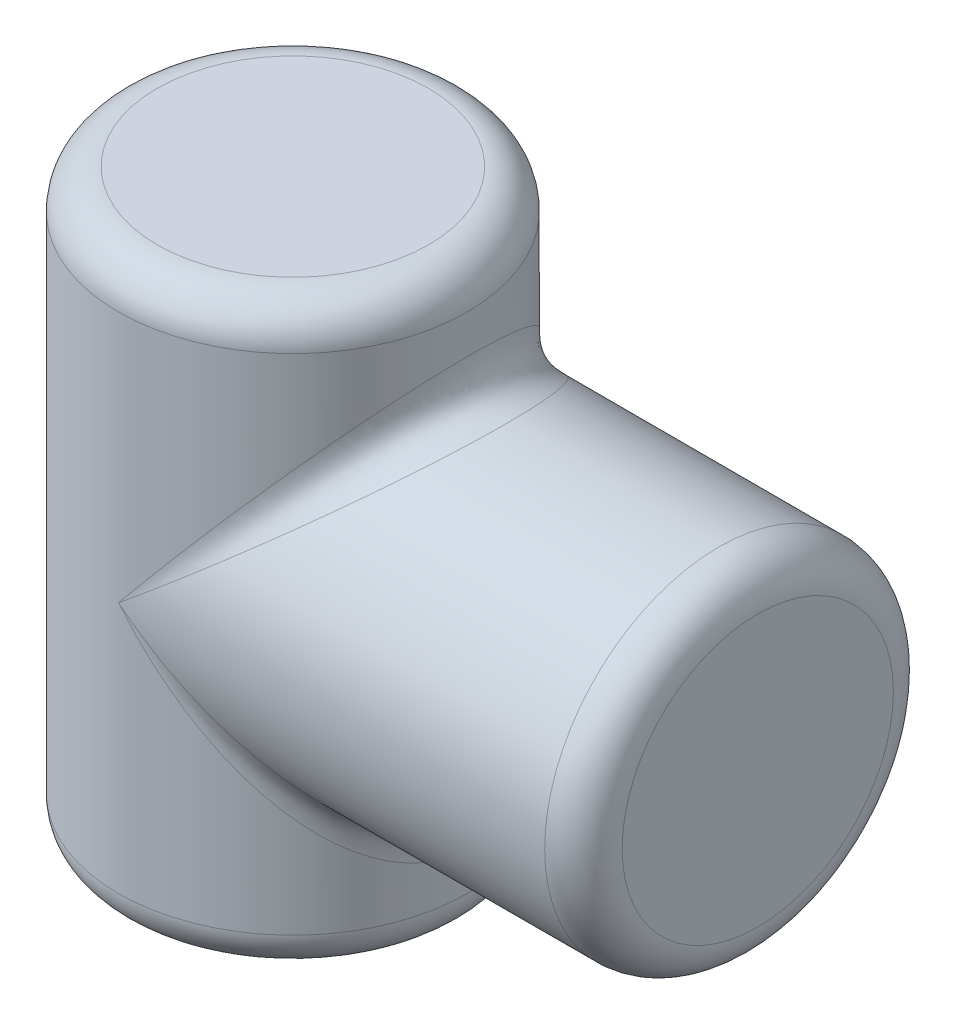
ISO-10303-21;
HEADER;
FILE_DESCRIPTION(('STEP AP214'),'2;1');
FILE_NAME('part.step','',(''),(''),'','','');
FILE_SCHEMA(('AUTOMOTIVE_DESIGN { 1 0 10303 214 1 1 1 1 }'));
ENDSEC;
DATA;
#1=APPLICATION_CONTEXT('core data for automotive mechanical design processes');
#2=APPLICATION_PROTOCOL_DEFINITION('international standard','automotive_design',2000,#1);
#3=PRODUCT_CONTEXT('',#1,'mechanical');
#4=PRODUCT('Part','Part','',(#3));
#5=PRODUCT_RELATED_PRODUCT_CATEGORY('part','',(#4));
#6=PRODUCT_DEFINITION_FORMATION('','',#4);
#7=PRODUCT_DEFINITION_CONTEXT('part definition',#1,'design');
#8=PRODUCT_DEFINITION('design','',#6,#7);
#9=PRODUCT_DEFINITION_SHAPE('','',#8);
#10=(LENGTH_UNIT() NAMED_UNIT(*) SI_UNIT(.MILLI.,.METRE.));
#11=(NAMED_UNIT(*) PLANE_ANGLE_UNIT() SI_UNIT($,.RADIAN.));
#12=(NAMED_UNIT(*) SI_UNIT($,.STERADIAN.) SOLID_ANGLE_UNIT());
#13=UNCERTAINTY_MEASURE_WITH_UNIT(LENGTH_MEASURE(1.E-05),#10,'distance_accuracy_value','');
#14=(GEOMETRIC_REPRESENTATION_CONTEXT(3) GLOBAL_UNCERTAINTY_ASSIGNED_CONTEXT((#13)) GLOBAL_UNIT_ASSIGNED_CONTEXT((#10,
#11,#12)) REPRESENTATION_CONTEXT('',''));
#15=CARTESIAN_POINT('',(0.,0.,0.));
#16=DIRECTION('',(0.,0.,1.));
#17=DIRECTION('',(1.,0.,0.));
#18=AXIS2_PLACEMENT_3D('',#15,#16,#17);
#19=CARTESIAN_POINT('',(0.,150.,0.));
#20=DIRECTION('',(0.,-1.,0.));
#21=DIRECTION('',(0.,0.,-1.));
#22=AXIS2_PLACEMENT_3D('',#19,#20,#21);
#23=CYLINDRICAL_SURFACE('',#22,45.);
#24=CARTESIAN_POINT('',(0.,140.,0.));
#25=DIRECTION('',(0.,1.,0.));
#26=DIRECTION('',(0.,0.,1.));
#27=AXIS2_PLACEMENT_3D('',#24,#25,#26);
#28=CIRCLE('',#27,45.);
#29=CARTESIAN_POINT('',(0.,140.,45.));
#30=VERTEX_POINT('',#29);
#31=EDGE_CURVE('E181',#30,#30,#28,.F.);
#32=ORIENTED_EDGE('',*,*,#31,.T.);
#33=EDGE_LOOP('',(#32));
#34=FACE_BOUND('',#33,.T.);
#35=CARTESIAN_POINT('',(0.,10.,0.));
#36=DIRECTION('',(0.,1.,0.));
#37=DIRECTION('',(0.,0.,1.));
#38=AXIS2_PLACEMENT_3D('',#35,#36,#37);
#39=CIRCLE('',#38,45.);
#40=CARTESIAN_POINT('',(0.,10.,45.));
#41=VERTEX_POINT('',#40);
#42=EDGE_CURVE('E178',#41,#41,#39,.T.);
#43=ORIENTED_EDGE('',*,*,#42,.T.);
#44=EDGE_LOOP('',(#43));
#45=FACE_BOUND('',#44,.T.);
#46=CARTESIAN_POINT('',(0.,75.,-45.));
#47=CARTESIAN_POINT('',(2.94524311290272,78.5997415823966,-45.));
#48=CARTESIAN_POINT('',(8.83564470275748,85.7991213033888,-44.4198425579063));
#49=CARTESIAN_POINT('',(17.3317658153497,96.1832693298669,-41.8425767562001));
#50=CARTESIAN_POINT('',(25.1618187744183,105.753334057624,-37.6573241953405));
#51=CARTESIAN_POINT('',(32.0249220022702,114.141571336108,-32.0249217841248));
#52=CARTESIAN_POINT('',(37.6573241368687,121.025618389506,-25.1618195885281));
#53=CARTESIAN_POINT('',(41.8425767719426,126.140927165708,-17.3317627770553));
#54=CARTESIAN_POINT('',(44.4198425534085,129.290918676388,-8.83565604182475));
#55=CARTESIAN_POINT('',(45.2900787232958,130.354540661806,0.));
#56=CARTESIAN_POINT('',(44.4198425534085,129.290918676388,8.83565604182487));
#57=CARTESIAN_POINT('',(41.8425767719426,126.140927165708,17.3317627770554));
#58=CARTESIAN_POINT('',(37.6573241368686,121.025618389506,25.1618195885282));
#59=CARTESIAN_POINT('',(32.0249220022704,114.141571336107,32.0249217841247));
#60=CARTESIAN_POINT('',(25.1618187744181,105.753334057625,37.6573241953406));
#61=CARTESIAN_POINT('',(17.3317658153497,96.1832693298604,41.8425767562001));
#62=CARTESIAN_POINT('',(8.83564470275734,85.799121303413,44.4198425579063));
#63=CARTESIAN_POINT('',(2.9452431129027,78.5997415823443,45.));
#64=CARTESIAN_POINT('',(0.,75.,45.));
#65=B_SPLINE_CURVE_WITH_KNOTS('',3,(#46,#47,#48,#49,#50,#51,#52,#53,#54,#55,#56,#57,#58,#59,#60,
#61,#62,#63,#64),.UNSPECIFIED.,.F.,.F.,(4,1,1,1,1,1,1,1,1,1,1,1,1,1,1,1,4),(1.5707963267949,
1.76714586764426,1.96349540849362,2.15984494934298,2.35619449019235,2.55254403104171,
2.74889357189107,2.94524311274043,3.14159265358979,3.33794219443915,3.53429173528852,
3.73064127613788,3.92699081698724,4.1233403578366,4.31968989868597,4.51603943953533,
4.71238898038469),.UNSPECIFIED.);
#66=CARTESIAN_POINT('',(0.,75.,45.));
#67=VERTEX_POINT('',#66);
#68=CARTESIAN_POINT('',(0.,75.,-45.));
#69=VERTEX_POINT('',#68);
#70=EDGE_CURVE('E63',#67,#69,#65,.F.);
#71=ORIENTED_EDGE('',*,*,#70,.T.);
#72=CARTESIAN_POINT('',(0.,75.,45.));
#73=CARTESIAN_POINT('',(2.94524311290272,71.4002584176034,45.));
#74=CARTESIAN_POINT('',(8.83564470275748,64.2008786966112,44.4198425579063));
#75=CARTESIAN_POINT('',(17.3317658153497,53.8167306701331,41.8425767562001));
#76=CARTESIAN_POINT('',(25.1618187744183,44.2466659423764,37.6573241953406));
#77=CARTESIAN_POINT('',(32.0249220022702,35.8584286638923,32.0249217841249));
#78=CARTESIAN_POINT('',(37.6573241368687,28.9743816104938,25.1618195885281));
#79=CARTESIAN_POINT('',(41.8425767719426,23.8590728342924,17.3317627770553));
#80=CARTESIAN_POINT('',(44.4198425534085,20.7090813236118,8.83565604182476));
#81=CARTESIAN_POINT('',(45.2900787232958,19.6454593381941,0.));
#82=CARTESIAN_POINT('',(44.4198425534085,20.7090813236118,-8.83565604182486));
#83=CARTESIAN_POINT('',(41.8425767719426,23.8590728342925,-17.3317627770554));
#84=CARTESIAN_POINT('',(37.6573241368686,28.9743816104938,-25.1618195885282));
#85=CARTESIAN_POINT('',(32.0249220022704,35.8584286638926,-32.0249217841247));
#86=CARTESIAN_POINT('',(25.1618187744181,44.2466659423748,-37.6573241953406));
#87=CARTESIAN_POINT('',(17.3317658153497,53.8167306701396,-41.8425767562001));
#88=CARTESIAN_POINT('',(8.83564470275734,64.2008786965871,-44.4198425579063));
#89=CARTESIAN_POINT('',(2.9452431129027,71.4002584176557,-45.));
#90=CARTESIAN_POINT('',(0.,75.,-45.));
#91=B_SPLINE_CURVE_WITH_KNOTS('',3,(#72,#73,#74,#75,#76,#77,#78,#79,#80,#81,#82,#83,#84,#85,#86,
#87,#88,#89,#90),.UNSPECIFIED.,.F.,.F.,(4,1,1,1,1,1,1,1,1,1,1,1,1,1,1,1,4),(1.5707963267949,
1.76714586764426,1.96349540849362,2.15984494934298,2.35619449019235,2.55254403104171,
2.74889357189107,2.94524311274043,3.14159265358979,3.33794219443915,3.53429173528852,
3.73064127613788,3.92699081698724,4.1233403578366,4.31968989868597,4.51603943953533,
4.71238898038469),.UNSPECIFIED.);
#92=EDGE_CURVE('E57',#69,#67,#91,.F.);
#93=ORIENTED_EDGE('',*,*,#92,.T.);
#94=EDGE_LOOP('',(#71,#93));
#95=FACE_BOUND('',#94,.T.);
#96=ADVANCED_FACE('F43',(#34,#45,#95),#23,.T.);
#97=CARTESIAN_POINT('',(0.,150.,0.));
#98=DIRECTION('',(0.,1.,0.));
#99=DIRECTION('',(0.,0.,1.));
#100=AXIS2_PLACEMENT_3D('',#97,#98,#99);
#101=PLANE('',#100);
#102=CARTESIAN_POINT('',(0.,150.,0.));
#103=DIRECTION('',(0.,1.,0.));
#104=DIRECTION('',(0.,0.,1.));
#105=AXIS2_PLACEMENT_3D('',#102,#103,#104);
#106=CIRCLE('',#105,35.);
#107=CARTESIAN_POINT('',(0.,150.,35.));
#108=VERTEX_POINT('',#107);
#109=EDGE_CURVE('E76',#108,#108,#106,.T.);
#110=ORIENTED_EDGE('',*,*,#109,.T.);
#111=EDGE_LOOP('',(#110));
#112=FACE_BOUND('',#111,.T.);
#113=ADVANCED_FACE('F199',(#112),#101,.T.);
#114=CARTESIAN_POINT('',(0.,0.,0.));
#115=DIRECTION('',(0.,1.,0.));
#116=DIRECTION('',(0.,0.,1.));
#117=AXIS2_PLACEMENT_3D('',#114,#115,#116);
#118=PLANE('',#117);
#119=CARTESIAN_POINT('',(0.,0.,0.));
#120=DIRECTION('',(0.,1.,0.));
#121=DIRECTION('',(0.,0.,1.));
#122=AXIS2_PLACEMENT_3D('',#119,#120,#121);
#123=CIRCLE('',#122,35.);
#124=CARTESIAN_POINT('',(0.,0.,35.));
#125=VERTEX_POINT('',#124);
#126=EDGE_CURVE('E184',#125,#125,#123,.F.);
#127=ORIENTED_EDGE('',*,*,#126,.T.);
#128=EDGE_LOOP('',(#127));
#129=FACE_BOUND('',#128,.T.);
#130=ADVANCED_FACE('F205',(#129),#118,.F.);
#131=CARTESIAN_POINT('',(120.,75.,0.));
#132=DIRECTION('',(-1.,0.,0.));
#133=DIRECTION('',(0.,0.,1.));
#134=AXIS2_PLACEMENT_3D('',#131,#132,#133);
#135=CYLINDRICAL_SURFACE('',#134,45.);
#136=CARTESIAN_POINT('',(110.,75.,0.));
#137=DIRECTION('',(1.,0.,0.));
#138=DIRECTION('',(0.,0.,-1.));
#139=AXIS2_PLACEMENT_3D('',#136,#137,#138);
#140=CIRCLE('',#139,45.);
#141=CARTESIAN_POINT('',(110.,75.,-45.));
#142=VERTEX_POINT('',#141);
#143=EDGE_CURVE('E12',#142,#142,#140,.F.);
#144=ORIENTED_EDGE('',*,*,#143,.T.);
#145=EDGE_LOOP('',(#144));
#146=FACE_BOUND('',#145,.T.);
#147=CARTESIAN_POINT('',(0.,75.,45.));
#148=CARTESIAN_POINT('',(3.59974158243664,77.9452431127758,45.));
#149=CARTESIAN_POINT('',(10.7991213033701,83.8356447028163,44.4198425579063));
#150=CARTESIAN_POINT('',(21.1832693298719,92.331765815334,41.8425767562001));
#151=CARTESIAN_POINT('',(30.7533340576221,100.161818774422,37.6573241953406));
#152=CARTESIAN_POINT('',(39.1415713361082,107.024922002269,32.0249217841248));
#153=CARTESIAN_POINT('',(46.025618389506,112.657324136869,25.1618195885282));
#154=CARTESIAN_POINT('',(51.1409271657076,116.842576771943,17.3317627770554));
#155=CARTESIAN_POINT('',(54.2909186763881,119.419842553408,8.83565604182487));
#156=CARTESIAN_POINT('',(55.3545406618059,120.290078723296,0.));
#157=CARTESIAN_POINT('',(54.2909186763881,119.419842553409,-8.83565604182475));
#158=CARTESIAN_POINT('',(51.1409271657076,116.842576771943,-17.3317627770552));
#159=CARTESIAN_POINT('',(46.0256183895061,112.657324136869,-25.1618195885281));
#160=CARTESIAN_POINT('',(39.141571336108,107.02492200227,-32.0249217841248));
#161=CARTESIAN_POINT('',(30.7533340576223,100.161818774419,-37.6573241953405));
#162=CARTESIAN_POINT('',(21.1832693298719,92.3317658153477,-41.8425767562001));
#163=CARTESIAN_POINT('',(10.7991213033703,83.8356447027652,-44.4198425579063));
#164=CARTESIAN_POINT('',(3.59974158243665,77.945243112886,-45.));
#165=CARTESIAN_POINT('',(0.,75.,-45.));
#166=B_SPLINE_CURVE_WITH_KNOTS('',3,(#147,#148,#149,#150,#151,#152,#153,#154,#155,#156,#157,
#158,#159,#160,#161,#162,#163,#164,#165),.UNSPECIFIED.,.F.,.F.,(4,1,1,1,1,1,1,1,1,1,1,1,1,1,1,1,
4),(1.5707963267949,1.76714586764426,1.96349540849362,2.15984494934298,2.35619449019234,
2.55254403104171,2.74889357189107,2.94524311274043,3.14159265358979,3.33794219443915,
3.53429173528852,3.73064127613788,3.92699081698724,4.1233403578366,4.31968989868597,
4.51603943953533,4.71238898038469),.UNSPECIFIED.);
#167=EDGE_CURVE('E67',#69,#67,#166,.F.);
#168=ORIENTED_EDGE('',*,*,#167,.T.);
#169=CARTESIAN_POINT('',(0.,75.,-45.));
#170=CARTESIAN_POINT('',(3.59974158243664,72.0547568872242,-45.));
#171=CARTESIAN_POINT('',(10.7991213033701,66.1643552971838,-44.4198425579063));
#172=CARTESIAN_POINT('',(21.1832693298719,57.668234184666,-41.8425767562001));
#173=CARTESIAN_POINT('',(30.7533340576221,49.8381812255776,-37.6573241953406));
#174=CARTESIAN_POINT('',(39.1415713361082,42.9750779977308,-32.0249217841247));
#175=CARTESIAN_POINT('',(46.025618389506,37.3426758631312,-25.1618195885282));
#176=CARTESIAN_POINT('',(51.1409271657076,33.1574232280575,-17.3317627770554));
#177=CARTESIAN_POINT('',(54.2909186763881,30.5801574465915,-8.83565604182485));
#178=CARTESIAN_POINT('',(55.354540661806,29.7099212767042,0.));
#179=CARTESIAN_POINT('',(54.2909186763881,30.5801574465915,8.83565604182475));
#180=CARTESIAN_POINT('',(51.1409271657076,33.1574232280574,17.3317627770553));
#181=CARTESIAN_POINT('',(46.0256183895061,37.3426758631313,25.1618195885281));
#182=CARTESIAN_POINT('',(39.141571336108,42.9750779977299,32.0249217841249));
#183=CARTESIAN_POINT('',(30.7533340576223,49.8381812255812,37.6573241953406));
#184=CARTESIAN_POINT('',(21.1832693298719,57.6682341846524,41.8425767562001));
#185=CARTESIAN_POINT('',(10.7991213033702,66.1643552972348,44.4198425579063));
#186=CARTESIAN_POINT('',(3.59974158243665,72.054756887114,45.));
#187=CARTESIAN_POINT('',(0.,75.,45.));
#188=B_SPLINE_CURVE_WITH_KNOTS('',3,(#169,#170,#171,#172,#173,#174,#175,#176,#177,#178,#179,
#180,#181,#182,#183,#184,#185,#186,#187),.UNSPECIFIED.,.F.,.F.,(4,1,1,1,1,1,1,1,1,1,1,1,1,1,1,1,
4),(1.5707963267949,1.76714586764426,1.96349540849362,2.15984494934298,2.35619449019234,
2.55254403104171,2.74889357189107,2.94524311274043,3.14159265358979,3.33794219443915,
3.53429173528852,3.73064127613788,3.92699081698724,4.1233403578366,4.31968989868597,
4.51603943953533,4.71238898038469),.UNSPECIFIED.);
#189=EDGE_CURVE('E72',#67,#69,#188,.F.);
#190=ORIENTED_EDGE('',*,*,#189,.T.);
#191=EDGE_LOOP('',(#168,#190));
#192=FACE_BOUND('',#191,.T.);
#193=ADVANCED_FACE('F81',(#146,#192),#135,.T.);
#194=CARTESIAN_POINT('',(120.,75.,0.));
#195=DIRECTION('',(1.,0.,0.));
#196=DIRECTION('',(0.,0.,-1.));
#197=AXIS2_PLACEMENT_3D('',#194,#195,#196);
#198=PLANE('',#197);
#199=CARTESIAN_POINT('',(120.,75.,0.));
#200=DIRECTION('',(1.,0.,0.));
#201=DIRECTION('',(0.,0.,-1.));
#202=AXIS2_PLACEMENT_3D('',#199,#200,#201);
#203=CIRCLE('',#202,35.);
#204=CARTESIAN_POINT('',(120.,75.,-35.));
#205=VERTEX_POINT('',#204);
#206=EDGE_CURVE('E51',#205,#205,#203,.T.);
#207=ORIENTED_EDGE('',*,*,#206,.T.);
#208=EDGE_LOOP('',(#207));
#209=FACE_BOUND('',#208,.T.);
#210=ADVANCED_FACE('F107',(#209),#198,.T.);
#211=CARTESIAN_POINT('',(0.,75.,-45.));
#212=CARTESIAN_POINT('',(2.9452431129027,71.4002584176557,-45.));
#213=CARTESIAN_POINT('',(8.83564470275734,64.2008786965871,-44.4198425579063));
#214=CARTESIAN_POINT('',(17.3317658153497,53.8167306701396,-41.8425767562001));
#215=CARTESIAN_POINT('',(25.1618187744181,44.2466659423748,-37.6573241953406));
#216=CARTESIAN_POINT('',(32.0249220022704,35.8584286638926,-32.0249217841247));
#217=CARTESIAN_POINT('',(37.6573241368686,28.9743816104938,-25.1618195885282));
#218=CARTESIAN_POINT('',(41.8425767719426,23.8590728342925,-17.3317627770554));
#219=CARTESIAN_POINT('',(44.4198425534085,20.7090813236118,-8.83565604182486));
#220=CARTESIAN_POINT('',(45.2900787232958,19.6454593381941,0.));
#221=CARTESIAN_POINT('',(44.4198425534085,20.7090813236118,8.83565604182476));
#222=CARTESIAN_POINT('',(41.8425767719426,23.8590728342924,17.3317627770553));
#223=CARTESIAN_POINT('',(37.6573241368687,28.9743816104938,25.1618195885281));
#224=CARTESIAN_POINT('',(32.0249220022702,35.8584286638923,32.0249217841249));
#225=CARTESIAN_POINT('',(25.1618187744183,44.2466659423764,37.6573241953406));
#226=CARTESIAN_POINT('',(17.3317658153497,53.8167306701331,41.8425767562001));
#227=CARTESIAN_POINT('',(8.83564470275748,64.2008786966112,44.4198425579063));
#228=CARTESIAN_POINT('',(2.94524311290272,71.4002584176034,45.));
#229=CARTESIAN_POINT('',(0.,75.,45.));
#230=CARTESIAN_POINT('',(0.,75.,-45.));
#231=CARTESIAN_POINT('',(3.00432355410428,71.4593388588349,-44.999999999947));
#232=CARTESIAN_POINT('',(9.01287035016405,64.3781161036662,-44.3962863537833));
#233=CARTESIAN_POINT('',(17.6563556643938,54.1821709665628,-41.7194474839704));
#234=CARTESIAN_POINT('',(25.576349787985,44.8220760532414,-37.3904857830518));
#235=CARTESIAN_POINT('',(32.4503575465156,36.6746462570679,-31.606330687735));
#236=CARTESIAN_POINT('',(38.0060043362288,30.0640079067424,-24.6380689964679));
#237=CARTESIAN_POINT('',(42.0445223715027,25.2356141797908,-16.8190668237202));
#238=CARTESIAN_POINT('',(44.4660836003393,22.3258638347182,-8.50660699708308));
#239=CARTESIAN_POINT('',(45.2669581997308,21.3600388555505,0.));
#240=CARTESIAN_POINT('',(44.4660836007377,22.3258638351165,8.50660699708295));
#241=CARTESIAN_POINT('',(42.0445223699092,25.2356141781972,16.8190668237202));
#242=CARTESIAN_POINT('',(38.0060043422045,30.064007912718,24.6380689964674));
#243=CARTESIAN_POINT('',(32.4503575242065,36.6746462347588,31.6063306877367));
#244=CARTESIAN_POINT('',(25.5763498712453,44.8220761365026,37.3904857830459));
#245=CARTESIAN_POINT('',(17.6563553536622,54.1821706558265,41.7194474839924));
#246=CARTESIAN_POINT('',(9.01287150983048,64.3781172633498,44.3962863537013));
#247=CARTESIAN_POINT('',(3.00432105537079,71.4593363600636,45.0000000001236));
#248=CARTESIAN_POINT('',(0.,75.,45.));
#249=CARTESIAN_POINT('',(0.,75.,-45.));
#250=CARTESIAN_POINT('',(3.064202110147,71.5192174149292,-44.9999999999294));
#251=CARTESIAN_POINT('',(9.19249015071311,64.5577496622029,-44.3718130756703));
#252=CARTESIAN_POINT('',(17.9845116338516,54.5527329753035,-41.5916723197504));
#253=CARTESIAN_POINT('',(25.9933810825555,45.4057368625042,-37.1142383284086));
#254=CARTESIAN_POINT('',(32.874753007169,37.502067459969,-31.1749451317395));
#255=CARTESIAN_POINT('',(38.3492511225423,31.165944677658,-24.1024362068071));
#256=CARTESIAN_POINT('',(42.2397671648765,26.6214300259863,-16.3004144403785));
#257=CARTESIAN_POINT('',(44.5099270170906,23.9452232807035,-8.17738682361655));
#258=CARTESIAN_POINT('',(45.2450364912677,23.0733299054796,0.));
#259=CARTESIAN_POINT('',(44.5099270178386,23.9452232814514,8.17738682361642));
#260=CARTESIAN_POINT('',(42.2397671618849,26.6214300229946,16.3004144403785));
#261=CARTESIAN_POINT('',(38.3492511337608,31.1659446888765,24.1024362068064));
#262=CARTESIAN_POINT('',(32.8747529652865,37.5020674180864,31.174945131742));
#263=CARTESIAN_POINT('',(25.9933812388665,45.4057370188166,37.1142383283997));
#264=CARTESIAN_POINT('',(17.9845110504904,54.5527323919363,41.5916723197834));
#265=CARTESIAN_POINT('',(9.1924923278471,64.5577518393593,44.3718130755474));
#266=CARTESIAN_POINT('',(3.06419741907565,71.5192127238086,45.0000000001943));
#267=CARTESIAN_POINT('',(0.,75.,45.));
#268=CARTESIAN_POINT('',(0.,75.,-45.));
#269=CARTESIAN_POINT('',(3.20306103073612,71.6580763353917,-44.999999999894));
#270=CARTESIAN_POINT('',(9.60906389259178,64.9743505272937,-44.3270822603956));
#271=CARTESIAN_POINT('',(18.7666986251514,55.4123826033832,-41.3583219495882));
#272=CARTESIAN_POINT('',(27.0417264063417,46.7579796578332,-36.610586352572));
#273=CARTESIAN_POINT('',(34.049405273974,39.4095348596355,-30.3909781971618));
#274=CARTESIAN_POINT('',(39.4912988362038,33.6804331031203,-23.1343572061654));
#275=CARTESIAN_POINT('',(43.2170991822511,29.7366332131106,-15.3704238522067));
#276=CARTESIAN_POINT('',(45.2877685153578,27.5306149176869,-7.59187834359867));
#277=CARTESIAN_POINT('',(45.9314945398147,26.8412942589071,0.));
#278=CARTESIAN_POINT('',(45.2877685155485,27.5306149178776,7.59187834359853));
#279=CARTESIAN_POINT('',(43.2170991814883,29.7366332123477,15.3704238522068));
#280=CARTESIAN_POINT('',(39.4912988390643,33.6804331059808,23.1343572061648));
#281=CARTESIAN_POINT('',(34.0494052632951,39.409534848956,30.3909781971641));
#282=CARTESIAN_POINT('',(27.0417264461967,46.7579796976911,36.6105863525637));
#283=CARTESIAN_POINT('',(18.766698476411,55.4123824546308,41.358321949619));
#284=CARTESIAN_POINT('',(9.60906444769877,64.9743510824451,44.3270822602808));
#285=CARTESIAN_POINT('',(3.20305983464706,71.6580751392061,45.0000000001413));
#286=CARTESIAN_POINT('',(0.,75.,45.));
#287=CARTESIAN_POINT('',(0.,75.,-45.));
#288=CARTESIAN_POINT('',(3.34192072695,71.7969360318285,-44.999999999894));
#289=CARTESIAN_POINT('',(10.0256508360784,65.3909374706768,-44.3270822603956));
#290=CARTESIAN_POINT('',(19.5876170313024,56.2333010095619,-41.3583219495882));
#291=CARTESIAN_POINT('',(28.2420204400526,47.9582736915367,-36.610586352572));
#292=CARTESIAN_POINT('',(35.5904651141357,40.9505946997992,-30.3909781971618));
#293=CARTESIAN_POINT('',(41.3195669039092,35.5087011708251,-23.1343572061654));
#294=CARTESIAN_POINT('',(45.2633667850007,31.7829008158603,-15.3704238522067));
#295=CARTESIAN_POINT('',(47.4693850828389,29.7122314851681,-7.59187834359866));
#296=CARTESIAN_POINT('',(48.1587057408782,29.0685054599705,0.));
#297=CARTESIAN_POINT('',(47.4693850824557,29.7122314847848,7.59187834359854));
#298=CARTESIAN_POINT('',(45.263366786534,31.7829008173934,15.3704238522068));
#299=CARTESIAN_POINT('',(41.3195668981593,35.5087011650758,23.1343572061648));
#300=CARTESIAN_POINT('',(35.5904651356023,40.9505947212632,30.3909781971641));
#301=CARTESIAN_POINT('',(28.2420203599357,47.9582736114301,36.6105863525637));
#302=CARTESIAN_POINT('',(19.5876173303036,56.2333013085237,41.358321949619));
#303=CARTESIAN_POINT('',(10.0256497201904,65.3909363549358,44.3270822602808));
#304=CARTESIAN_POINT('',(3.3419231313548,71.7969384359157,45.0000000001413));
#305=CARTESIAN_POINT('',(0.,75.,45.));
#306=CARTESIAN_POINT('',(0.,75.,-45.));
#307=CARTESIAN_POINT('',(3.48078119894568,71.9357965036744,-44.9999999999294));
#308=CARTESIAN_POINT('',(10.4422509811,65.8075104926146,-44.3718130756703));
#309=CARTESIAN_POINT('',(20.447266852324,57.0154881937693,-41.5916723197504));
#310=CARTESIAN_POINT('',(29.5942631836829,49.0066189636334,-37.1142383284086));
#311=CARTESIAN_POINT('',(37.4979325276552,42.1252469804548,-31.1749451317395));
#312=CARTESIAN_POINT('',(43.8340553256581,36.6507488807739,-24.1024362068071));
#313=CARTESIAN_POINT('',(48.3785699731253,32.7602328342351,-16.3004144403785));
#314=CARTESIAN_POINT('',(51.0547767195342,30.490072983147,-8.17738682361655));
#315=CARTESIAN_POINT('',(51.9266700944581,29.75496350867,0.));
#316=CARTESIAN_POINT('',(51.05477671856,30.4900729821729,8.17738682361641));
#317=CARTESIAN_POINT('',(48.3785699770219,32.7602328381317,16.3004144403785));
#318=CARTESIAN_POINT('',(43.834055311046,36.6507488661616,24.1024362068064));
#319=CARTESIAN_POINT('',(37.4979325822072,42.1252470350073,31.174945131742));
#320=CARTESIAN_POINT('',(29.5942629800865,49.0066187600359,37.1142383283997));
#321=CARTESIAN_POINT('',(20.4472676121581,57.0154889536062,41.5916723197834));
#322=CARTESIAN_POINT('',(10.4422481453603,65.8075076568644,44.3718130755474));
#323=CARTESIAN_POINT('',(3.48078730911603,71.9358026138666,45.0000000001943));
#324=CARTESIAN_POINT('',(0.,75.,45.));
#325=CARTESIAN_POINT('',(0.,75.,-45.));
#326=CARTESIAN_POINT('',(3.54066044600616,71.9956757507521,-44.999999999947));
#327=CARTESIAN_POINT('',(10.6218842189582,65.9871299724532,-44.3962863537833));
#328=CARTESIAN_POINT('',(20.8178289469902,57.3436442491611,-41.7194474839704));
#329=CARTESIAN_POINT('',(30.177923969922,49.4236502351779,-37.3904857830518));
#330=CARTESIAN_POINT('',(38.3253537367255,42.5496424472779,-31.606330687735));
#331=CARTESIAN_POINT('',(44.9359920949206,36.9939956654342,-24.6380689964679));
#332=CARTESIAN_POINT('',(49.7643858197637,32.9554776280519,-16.8190668237202));
#333=CARTESIAN_POINT('',(52.6741361654008,30.5339163997797,-8.50660699708307));
#334=CARTESIAN_POINT('',(53.6399611444191,29.7330418002388,0.));
#335=CARTESIAN_POINT('',(52.6741361648861,30.5339163992649,8.50660699708295));
#336=CARTESIAN_POINT('',(49.7643858218227,32.9554776301107,16.8190668237202));
#337=CARTESIAN_POINT('',(44.9359920871999,36.9939956577134,24.6380689964674));
#338=CARTESIAN_POINT('',(38.3253537655498,42.549642476102,31.6063306877367));
#339=CARTESIAN_POINT('',(30.1779238623454,49.4236501276028,37.3904857830459));
#340=CARTESIAN_POINT('',(20.817829348473,57.343644650637,41.7194474839924));
#341=CARTESIAN_POINT('',(10.621882720604,65.9871284741246,44.3962863537013));
#342=CARTESIAN_POINT('',(3.54066367451122,71.9956789792013,45.0000000001236));
#343=CARTESIAN_POINT('',(0.,75.,45.));
#344=CARTESIAN_POINT('',(0.,75.,-45.));
#345=CARTESIAN_POINT('',(3.59974158243664,72.0547568872242,-45.));
#346=CARTESIAN_POINT('',(10.7991213033701,66.1643552971838,-44.4198425579063));
#347=CARTESIAN_POINT('',(21.1832693298719,57.668234184666,-41.8425767562001));
#348=CARTESIAN_POINT('',(30.7533340576221,49.8381812255776,-37.6573241953406));
#349=CARTESIAN_POINT('',(39.1415713361082,42.9750779977308,-32.0249217841247));
#350=CARTESIAN_POINT('',(46.025618389506,37.3426758631312,-25.1618195885282));
#351=CARTESIAN_POINT('',(51.1409271657076,33.1574232280575,-17.3317627770554));
#352=CARTESIAN_POINT('',(54.2909186763881,30.5801574465915,-8.83565604182486));
#353=CARTESIAN_POINT('',(55.354540661806,29.7099212767042,0.));
#354=CARTESIAN_POINT('',(54.2909186763881,30.5801574465915,8.83565604182476));
#355=CARTESIAN_POINT('',(51.1409271657077,33.1574232280574,17.3317627770553));
#356=CARTESIAN_POINT('',(46.0256183895061,37.3426758631313,25.1618195885281));
#357=CARTESIAN_POINT('',(39.141571336108,42.9750779977299,32.0249217841249));
#358=CARTESIAN_POINT('',(30.7533340576223,49.8381812255812,37.6573241953406));
#359=CARTESIAN_POINT('',(21.1832693298719,57.6682341846524,41.8425767562001));
#360=CARTESIAN_POINT('',(10.7991213033703,66.1643552972348,44.4198425579063));
#361=CARTESIAN_POINT('',(3.59974158243665,72.054756887114,45.));
#362=CARTESIAN_POINT('',(0.,75.,45.));
#363=B_SPLINE_SURFACE_WITH_KNOTS('',5,3,((#211,#212,#213,#214,#215,#216,#217,#218,#219,#220,
#221,#222,#223,#224,#225,#226,#227,#228,#229),(#230,#231,#232,#233,#234,#235,#236,#237,#238,
#239,#240,#241,#242,#243,#244,#245,#246,#247,#248),(#249,#250,#251,#252,#253,#254,#255,#256,
#257,#258,#259,#260,#261,#262,#263,#264,#265,#266,#267),(#268,#269,#270,#271,#272,#273,#274,
#275,#276,#277,#278,#279,#280,#281,#282,#283,#284,#285,#286),(#287,#288,#289,#290,#291,#292,
#293,#294,#295,#296,#297,#298,#299,#300,#301,#302,#303,#304,#305),(#306,#307,#308,#309,#310,
#311,#312,#313,#314,#315,#316,#317,#318,#319,#320,#321,#322,#323,#324),(#325,#326,#327,#328,
#329,#330,#331,#332,#333,#334,#335,#336,#337,#338,#339,#340,#341,#342,#343),(#344,#345,#346,
#347,#348,#349,#350,#351,#352,#353,#354,#355,#356,#357,#358,#359,#360,#361,#362)),.UNSPECIFIED.,
.F.,.F.,.F.,(6,2,6),(4,1,1,1,1,1,1,1,1,1,1,1,1,1,1,1,4),(0.,0.5,1.),(1.5707963267949,
1.76714586764426,1.96349540849362,2.15984494934298,2.35619449019234,2.55254403104171,
2.74889357189107,2.94524311274043,3.14159265358979,3.33794219443915,3.53429173528852,
3.73064127613788,3.92699081698724,4.1233403578366,4.31968989868597,4.51603943953533,
4.71238898038469),.UNSPECIFIED.);
#364=ORIENTED_EDGE('',*,*,#189,.F.);
#365=ORIENTED_EDGE('',*,*,#92,.F.);
#366=EDGE_LOOP('',(#364,#365));
#367=FACE_BOUND('',#366,.T.);
#368=ADVANCED_FACE('F85',(#367),#363,.T.);
#369=CARTESIAN_POINT('',(0.,75.,45.));
#370=CARTESIAN_POINT('',(2.9452431129027,78.5997415823443,45.));
#371=CARTESIAN_POINT('',(8.83564470275734,85.799121303413,44.4198425579063));
#372=CARTESIAN_POINT('',(17.3317658153497,96.1832693298604,41.8425767562001));
#373=CARTESIAN_POINT('',(25.1618187744181,105.753334057625,37.6573241953406));
#374=CARTESIAN_POINT('',(32.0249220022704,114.141571336107,32.0249217841247));
#375=CARTESIAN_POINT('',(37.6573241368686,121.025618389506,25.1618195885282));
#376=CARTESIAN_POINT('',(41.8425767719426,126.140927165708,17.3317627770554));
#377=CARTESIAN_POINT('',(44.4198425534085,129.290918676388,8.83565604182487));
#378=CARTESIAN_POINT('',(45.2900787232958,130.354540661806,0.));
#379=CARTESIAN_POINT('',(44.4198425534085,129.290918676388,-8.83565604182475));
#380=CARTESIAN_POINT('',(41.8425767719426,126.140927165708,-17.3317627770553));
#381=CARTESIAN_POINT('',(37.6573241368687,121.025618389506,-25.1618195885281));
#382=CARTESIAN_POINT('',(32.0249220022702,114.141571336108,-32.0249217841248));
#383=CARTESIAN_POINT('',(25.1618187744183,105.753334057624,-37.6573241953405));
#384=CARTESIAN_POINT('',(17.3317658153497,96.1832693298669,-41.8425767562001));
#385=CARTESIAN_POINT('',(8.83564470275748,85.7991213033888,-44.4198425579063));
#386=CARTESIAN_POINT('',(2.94524311290272,78.5997415823966,-45.));
#387=CARTESIAN_POINT('',(0.,75.,-45.));
#388=CARTESIAN_POINT('',(0.,75.,45.));
#389=CARTESIAN_POINT('',(3.00432135820199,78.5406633371154,45.0000000001236));
#390=CARTESIAN_POINT('',(9.01287136928584,85.6218828771898,44.3962863537013));
#391=CARTESIAN_POINT('',(17.656355391321,95.817829306516,41.7194474839924));
#392=CARTESIAN_POINT('',(25.5763498611545,105.177923873587,37.3904857830459));
#393=CARTESIAN_POINT('',(32.4503575269103,113.325353762538,31.6063306877366));
#394=CARTESIAN_POINT('',(38.0060043414806,119.935992088006,24.6380689964674));
#395=CARTESIAN_POINT('',(42.0445223701009,124.764385821611,16.8190668237203));
#396=CARTESIAN_POINT('',(44.4660836006944,127.674136164927,8.50660699708305));
#397=CARTESIAN_POINT('',(45.2669581997121,128.639961144468,0.));
#398=CARTESIAN_POINT('',(44.4660836004573,127.674136165164,-8.50660699708297));
#399=CARTESIAN_POINT('',(42.0445223710493,124.764385820663,-16.8190668237201));
#400=CARTESIAN_POINT('',(38.0060043379245,119.935992091562,-24.6380689964678));
#401=CARTESIAN_POINT('',(32.4503575401865,113.325353749262,-31.6063306877351));
#402=CARTESIAN_POINT('',(25.5763498116053,105.177923923135,-37.3904857830517));
#403=CARTESIAN_POINT('',(17.6563555762424,95.8178291216032,-41.7194474839704));
#404=CARTESIAN_POINT('',(9.01287067914991,85.621883567294,-44.3962863537833));
#405=CARTESIAN_POINT('',(3.00432284523862,78.5406618501478,-44.999999999947));
#406=CARTESIAN_POINT('',(0.,75.,-45.));
#407=CARTESIAN_POINT('',(0.,75.,45.));
#408=CARTESIAN_POINT('',(3.06419800937686,78.4807866859678,45.0000000001943));
#409=CARTESIAN_POINT('',(9.19249205388713,85.4422484345643,44.3718130755474));
#410=CARTESIAN_POINT('',(17.9845111238977,95.4472675346662,41.5916723197834));
#411=CARTESIAN_POINT('',(25.993381219197,104.59426300085,37.1142383283998));
#412=CARTESIAN_POINT('',(32.8747529705567,112.497932576644,31.1749451317419));
#413=CARTESIAN_POINT('',(38.3492511323497,118.834055312534,24.1024362068065));
#414=CARTESIAN_POINT('',(42.2397671622588,123.378569976632,16.3004144403787));
#415=CARTESIAN_POINT('',(44.509927017754,126.054776718633,8.17738682361651));
#416=CARTESIAN_POINT('',(45.2450364912321,126.926670094556,0.));
#417=CARTESIAN_POINT('',(44.5099270173178,126.054776719069,-8.17738682361646));
#418=CARTESIAN_POINT('',(42.2397671640034,123.378569974887,-16.3004144403784));
#419=CARTESIAN_POINT('',(38.3492511258075,118.834055319076,-24.1024362068071));
#420=CARTESIAN_POINT('',(32.8747529949812,112.497932552221,-31.1749451317396));
#421=CARTESIAN_POINT('',(25.993381128041,104.594263092,-37.1142383284085));
#422=CARTESIAN_POINT('',(17.9845114640977,95.4472671944899,-41.5916723197505));
#423=CARTESIAN_POINT('',(9.1924907842431,85.4422497041197,-44.3718130756703));
#424=CARTESIAN_POINT('',(3.06420074507996,78.4807839504562,-44.9999999999294));
#425=CARTESIAN_POINT('',(0.,75.,-45.));
#426=CARTESIAN_POINT('',(0.,75.,45.));
#427=CARTESIAN_POINT('',(3.20306106525443,78.3419236300256,45.0000000001413));
#428=CARTESIAN_POINT('',(9.60906387657175,85.0256494887563,44.3270822602808));
#429=CARTESIAN_POINT('',(18.7666986294439,94.5876173923163,41.358321949619));
#430=CARTESIAN_POINT('',(27.0417264051916,103.242020343319,36.6105863525638));
#431=CARTESIAN_POINT('',(34.0494052742821,110.590465140056,30.390978197164));
#432=CARTESIAN_POINT('',(39.4912988361219,116.319566896962,23.1343572061649));
#433=CARTESIAN_POINT('',(43.2170991822707,120.26336678687,15.3704238522069));
#434=CARTESIAN_POINT('',(45.2877685153611,122.46938508231,7.59187834359863));
#435=CARTESIAN_POINT('',(45.9314945397818,123.158705741126,0.));
#436=CARTESIAN_POINT('',(45.287768515677,122.469385081994,-7.59187834359856));
#437=CARTESIAN_POINT('',(43.2170991810075,120.263366788133,-15.3704238522067));
#438=CARTESIAN_POINT('',(39.4912988408592,116.319566892225,-23.1343572061651));
#439=CARTESIAN_POINT('',(34.0494052565963,110.590465157742,-30.3909781971627));
#440=CARTESIAN_POINT('',(27.0417264711969,103.242020277311,-36.6105863525689));
#441=CARTESIAN_POINT('',(18.7666983831087,94.5876176386636,-41.3583219495992));
#442=CARTESIAN_POINT('',(9.60906479590759,85.0256485693753,-44.3270822603546));
#443=CARTESIAN_POINT('',(3.20305908436137,78.3419256110166,-44.9999999999823));
#444=CARTESIAN_POINT('',(0.,75.,-45.));
#445=CARTESIAN_POINT('',(0.,75.,45.));
#446=CARTESIAN_POINT('',(3.34192395540141,78.2030607397907,45.0000000001413));
#447=CARTESIAN_POINT('',(10.0256493377489,84.60906402762,44.3270822602808));
#448=CARTESIAN_POINT('',(19.5876174327785,93.7666985889709,41.358321949619));
#449=CARTESIAN_POINT('',(28.2420203324776,102.041726416036,36.6105863525638));
#450=CARTESIAN_POINT('',(35.5904651429595,109.049405271378,30.390978197164));
#451=CARTESIAN_POINT('',(41.3195668961887,114.491298836895,23.1343572061649));
#452=CARTESIAN_POINT('',(45.2633667870588,118.217099182082,15.3704238522069));
#453=CARTESIAN_POINT('',(47.4693850823269,120.287768515344,7.59187834359863));
#454=CARTESIAN_POINT('',(48.158705740868,120.93149454004,0.));
#455=CARTESIAN_POINT('',(47.4693850830085,120.287768514662,-7.59187834359859));
#456=CARTESIAN_POINT('',(45.2633667843328,118.217099184808,-15.3704238522066));
#457=CARTESIAN_POINT('',(41.3195669064113,114.491298826672,-23.1343572061655));
#458=CARTESIAN_POINT('',(35.5904651047952,109.049405309544,-30.3909781971613));
#459=CARTESIAN_POINT('',(28.2420204749117,102.041726273594,-36.6105863525742));
#460=CARTESIAN_POINT('',(19.5876169012067,93.7666991205744,-41.3583219495794));
#461=CARTESIAN_POINT('',(10.0256513216021,84.609062043648,-44.3270822604283));
#462=CARTESIAN_POINT('',(3.34191968079205,78.2030650146565,-44.9999999998234));
#463=CARTESIAN_POINT('',(0.,75.,-45.));
#464=CARTESIAN_POINT('',(0.,75.,45.));
#465=CARTESIAN_POINT('',(3.48078667987096,78.0641980154753,45.0000000001943));
#466=CARTESIAN_POINT('',(10.4422484373938,84.1924920510568,44.3718130755474));
#467=CARTESIAN_POINT('',(20.4472675339079,92.9845111246561,41.5916723197834));
#468=CARTESIAN_POINT('',(29.5942630010533,100.993381218994,37.1142383283997));
#469=CARTESIAN_POINT('',(37.4979325765896,107.874752970612,31.1749451317419));
#470=CARTESIAN_POINT('',(43.8340553125501,113.349251132334,24.1024362068065));
#471=CARTESIAN_POINT('',(48.3785699766229,117.239767162267,16.3004144403787));
#472=CARTESIAN_POINT('',(51.0547767186516,119.509927017735,8.17738682361651));
#473=CARTESIAN_POINT('',(51.9266700944906,120.245036491298,0.));
#474=CARTESIAN_POINT('',(51.0547767193126,119.509927017074,-8.17738682361644));
#475=CARTESIAN_POINT('',(48.3785699739792,117.239767164911,-16.3004144403784));
#476=CARTESIAN_POINT('',(43.8340553224643,113.34925112242,-24.1024362068068));
#477=CARTESIAN_POINT('',(37.4979325395765,107.874753007625,-31.1749451317404));
#478=CARTESIAN_POINT('',(29.5942631391908,100.993381080852,-37.1142383284055));
#479=CARTESIAN_POINT('',(20.4472670183714,92.984511640209,-41.5916723197614));
#480=CARTESIAN_POINT('',(10.4422503614029,84.192490126987,-44.3718130756293));
#481=CARTESIAN_POINT('',(3.48078253420794,78.06420216127,-45.0000000000177));
#482=CARTESIAN_POINT('',(0.,75.,-45.));
#483=CARTESIAN_POINT('',(0.,75.,45.));
#484=CARTESIAN_POINT('',(3.54066333068448,78.0043213645749,45.0000000001236));
#485=CARTESIAN_POINT('',(10.6218828801744,84.0128713663281,44.3962863537013));
#486=CARTESIAN_POINT('',(20.8178293057162,92.6563553921135,41.7194474839924));
#487=CARTESIAN_POINT('',(30.1779238738018,100.576349860942,37.3904857830459));
#488=CARTESIAN_POINT('',(38.3253537624803,107.450357526967,31.6063306877366));
#489=CARTESIAN_POINT('',(44.9359920880217,113.006004341465,24.6380689964674));
#490=CARTESIAN_POINT('',(49.7643858216046,117.044522370107,16.8190668237203));
#491=CARTESIAN_POINT('',(52.6741361649362,119.466083600685,8.50660699708305));
#492=CARTESIAN_POINT('',(53.6399611444366,120.266958199744,0.));
#493=CARTESIAN_POINT('',(52.6741361652809,119.46608360034,-8.50660699708296));
#494=CARTESIAN_POINT('',(49.7643858202261,117.044522371486,-16.8190668237201));
#495=CARTESIAN_POINT('',(44.9359920931915,113.006004336295,-24.6380689964676));
#496=CARTESIAN_POINT('',(38.3253537431801,107.450357546268,-31.6063306877357));
#497=CARTESIAN_POINT('',(30.1779239458324,100.576349788908,-37.3904857830494));
#498=CARTESIAN_POINT('',(20.8178290368947,92.6563556609492,-41.7194474839792));
#499=CARTESIAN_POINT('',(10.6218838834304,84.01287036302,-44.3962863537505));
#500=CARTESIAN_POINT('',(3.54066116896865,78.004323526404,-45.0000000000177));
#501=CARTESIAN_POINT('',(0.,75.,-45.));
#502=CARTESIAN_POINT('',(0.,75.,45.));
#503=CARTESIAN_POINT('',(3.59974158243664,77.9452431127758,45.));
#504=CARTESIAN_POINT('',(10.7991213033701,83.8356447028163,44.4198425579063));
#505=CARTESIAN_POINT('',(21.1832693298719,92.331765815334,41.8425767562001));
#506=CARTESIAN_POINT('',(30.7533340576221,100.161818774422,37.6573241953406));
#507=CARTESIAN_POINT('',(39.1415713361082,107.024922002269,32.0249217841248));
#508=CARTESIAN_POINT('',(46.025618389506,112.657324136869,25.1618195885282));
#509=CARTESIAN_POINT('',(51.1409271657076,116.842576771943,17.3317627770554));
#510=CARTESIAN_POINT('',(54.2909186763881,119.419842553408,8.83565604182487));
#511=CARTESIAN_POINT('',(55.354540661806,120.290078723296,0.));
#512=CARTESIAN_POINT('',(54.2909186763881,119.419842553409,-8.83565604182475));
#513=CARTESIAN_POINT('',(51.1409271657077,116.842576771943,-17.3317627770553));
#514=CARTESIAN_POINT('',(46.0256183895061,112.657324136869,-25.1618195885281));
#515=CARTESIAN_POINT('',(39.141571336108,107.02492200227,-32.0249217841248));
#516=CARTESIAN_POINT('',(30.7533340576223,100.161818774419,-37.6573241953405));
#517=CARTESIAN_POINT('',(21.1832693298719,92.3317658153477,-41.8425767562001));
#518=CARTESIAN_POINT('',(10.7991213033703,83.8356447027652,-44.4198425579063));
#519=CARTESIAN_POINT('',(3.59974158243665,77.945243112886,-45.));
#520=CARTESIAN_POINT('',(0.,75.,-45.));
#521=B_SPLINE_SURFACE_WITH_KNOTS('',5,3,((#369,#370,#371,#372,#373,#374,#375,#376,#377,#378,
#379,#380,#381,#382,#383,#384,#385,#386,#387),(#388,#389,#390,#391,#392,#393,#394,#395,#396,
#397,#398,#399,#400,#401,#402,#403,#404,#405,#406),(#407,#408,#409,#410,#411,#412,#413,#414,
#415,#416,#417,#418,#419,#420,#421,#422,#423,#424,#425),(#426,#427,#428,#429,#430,#431,#432,
#433,#434,#435,#436,#437,#438,#439,#440,#441,#442,#443,#444),(#445,#446,#447,#448,#449,#450,
#451,#452,#453,#454,#455,#456,#457,#458,#459,#460,#461,#462,#463),(#464,#465,#466,#467,#468,
#469,#470,#471,#472,#473,#474,#475,#476,#477,#478,#479,#480,#481,#482),(#483,#484,#485,#486,
#487,#488,#489,#490,#491,#492,#493,#494,#495,#496,#497,#498,#499,#500,#501),(#502,#503,#504,
#505,#506,#507,#508,#509,#510,#511,#512,#513,#514,#515,#516,#517,#518,#519,#520)),.UNSPECIFIED.,
.F.,.F.,.F.,(6,2,6),(4,1,1,1,1,1,1,1,1,1,1,1,1,1,1,1,4),(0.,0.5,1.),(1.5707963267949,
1.76714586764426,1.96349540849362,2.15984494934298,2.35619449019234,2.55254403104171,
2.74889357189107,2.94524311274043,3.14159265358979,3.33794219443915,3.53429173528852,
3.73064127613788,3.92699081698724,4.1233403578366,4.31968989868597,4.51603943953533,
4.71238898038469),.UNSPECIFIED.);
#522=ORIENTED_EDGE('',*,*,#167,.F.);
#523=ORIENTED_EDGE('',*,*,#70,.F.);
#524=EDGE_LOOP('',(#522,#523));
#525=FACE_BOUND('',#524,.T.);
#526=ADVANCED_FACE('F65',(#525),#521,.T.);
#527=CARTESIAN_POINT('',(0.,140.,0.));
#528=DIRECTION('',(0.,1.,0.));
#529=DIRECTION('',(0.,0.,1.));
#530=AXIS2_PLACEMENT_3D('',#527,#528,#529);
#531=TOROIDAL_SURFACE('',#530,35.,10.);
#532=ORIENTED_EDGE('',*,*,#31,.F.);
#533=EDGE_LOOP('',(#532));
#534=FACE_BOUND('',#533,.T.);
#535=ORIENTED_EDGE('',*,*,#109,.F.);
#536=EDGE_LOOP('',(#535));
#537=FACE_BOUND('',#536,.T.);
#538=ADVANCED_FACE('F159',(#534,#537),#531,.T.);
#539=CARTESIAN_POINT('',(0.,10.,0.));
#540=DIRECTION('',(0.,1.,0.));
#541=DIRECTION('',(0.,0.,1.));
#542=AXIS2_PLACEMENT_3D('',#539,#540,#541);
#543=TOROIDAL_SURFACE('',#542,35.,10.);
#544=ORIENTED_EDGE('',*,*,#126,.F.);
#545=EDGE_LOOP('',(#544));
#546=FACE_BOUND('',#545,.T.);
#547=ORIENTED_EDGE('',*,*,#42,.F.);
#548=EDGE_LOOP('',(#547));
#549=FACE_BOUND('',#548,.T.);
#550=ADVANCED_FACE('F191',(#546,#549),#543,.T.);
#551=CARTESIAN_POINT('',(110.,75.,0.));
#552=DIRECTION('',(1.,0.,0.));
#553=DIRECTION('',(0.,0.,-1.));
#554=AXIS2_PLACEMENT_3D('',#551,#552,#553);
#555=TOROIDAL_SURFACE('',#554,35.,10.);
#556=ORIENTED_EDGE('',*,*,#143,.F.);
#557=EDGE_LOOP('',(#556));
#558=FACE_BOUND('',#557,.T.);
#559=ORIENTED_EDGE('',*,*,#206,.F.);
#560=EDGE_LOOP('',(#559));
#561=FACE_BOUND('',#560,.T.);
#562=ADVANCED_FACE('F45',(#558,#561),#555,.T.);
#563=CLOSED_SHELL('',(#96,#113,#130,#193,#210,#368,#526,#538,#550,#562));
#564=MANIFOLD_SOLID_BREP('B2',#563);
#565=ADVANCED_BREP_SHAPE_REPRESENTATION('',(#18,#564),#14);
#566=SHAPE_DEFINITION_REPRESENTATION(#9,#565);
ENDSEC;
END-ISO-10303-21;
